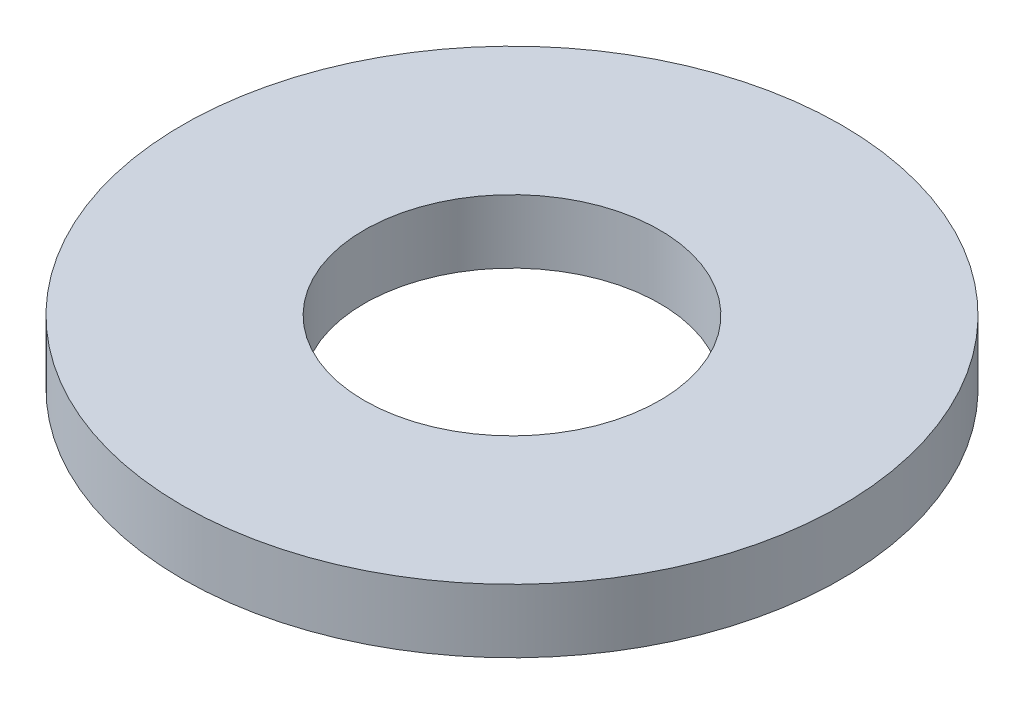
ISO-10303-21;
HEADER;
FILE_DESCRIPTION(('STEP AP214'),'2;1');
FILE_NAME('part.step','',(''),(''),'','','');
FILE_SCHEMA(('AUTOMOTIVE_DESIGN { 1 0 10303 214 1 1 1 1 }'));
ENDSEC;
DATA;
#1=APPLICATION_CONTEXT('core data for automotive mechanical design processes');
#2=APPLICATION_PROTOCOL_DEFINITION('international standard','automotive_design',2000,#1);
#3=PRODUCT_CONTEXT('',#1,'mechanical');
#4=PRODUCT('Part','Part','',(#3));
#5=PRODUCT_RELATED_PRODUCT_CATEGORY('part','',(#4));
#6=PRODUCT_DEFINITION_FORMATION('','',#4);
#7=PRODUCT_DEFINITION_CONTEXT('part definition',#1,'design');
#8=PRODUCT_DEFINITION('design','',#6,#7);
#9=PRODUCT_DEFINITION_SHAPE('','',#8);
#10=(LENGTH_UNIT() NAMED_UNIT(*) SI_UNIT(.MILLI.,.METRE.));
#11=(NAMED_UNIT(*) PLANE_ANGLE_UNIT() SI_UNIT($,.RADIAN.));
#12=(NAMED_UNIT(*) SI_UNIT($,.STERADIAN.) SOLID_ANGLE_UNIT());
#13=UNCERTAINTY_MEASURE_WITH_UNIT(LENGTH_MEASURE(1.E-05),#10,'distance_accuracy_value','');
#14=(GEOMETRIC_REPRESENTATION_CONTEXT(3) GLOBAL_UNCERTAINTY_ASSIGNED_CONTEXT((#13)) GLOBAL_UNIT_ASSIGNED_CONTEXT((#10,
#11,#12)) REPRESENTATION_CONTEXT('',''));
#15=CARTESIAN_POINT('',(0.,0.,0.));
#16=DIRECTION('',(0.,0.,1.));
#17=DIRECTION('',(1.,0.,0.));
#18=AXIS2_PLACEMENT_3D('',#15,#16,#17);
#19=CARTESIAN_POINT('',(0.,14.,0.));
#20=DIRECTION('',(0.,-1.,0.));
#21=DIRECTION('',(0.,0.,-1.));
#22=AXIS2_PLACEMENT_3D('',#19,#20,#21);
#23=CYLINDRICAL_SURFACE('',#22,72.5);
#24=CARTESIAN_POINT('',(0.,14.,0.));
#25=DIRECTION('',(0.,1.,0.));
#26=DIRECTION('',(0.,0.,1.));
#27=AXIS2_PLACEMENT_3D('',#24,#25,#26);
#28=CIRCLE('',#27,72.5);
#29=CARTESIAN_POINT('',(0.,14.,72.5));
#30=VERTEX_POINT('',#29);
#31=EDGE_CURVE('E10',#30,#30,#28,.T.);
#32=ORIENTED_EDGE('',*,*,#31,.F.);
#33=EDGE_LOOP('',(#32));
#34=FACE_BOUND('',#33,.T.);
#35=CARTESIAN_POINT('',(0.,0.,0.));
#36=DIRECTION('',(0.,1.,0.));
#37=DIRECTION('',(0.,0.,1.));
#38=AXIS2_PLACEMENT_3D('',#35,#36,#37);
#39=CIRCLE('',#38,72.5);
#40=CARTESIAN_POINT('',(0.,0.,72.5));
#41=VERTEX_POINT('',#40);
#42=EDGE_CURVE('E37',#41,#41,#39,.T.);
#43=ORIENTED_EDGE('',*,*,#42,.T.);
#44=EDGE_LOOP('',(#43));
#45=FACE_BOUND('',#44,.T.);
#46=ADVANCED_FACE('F40',(#34,#45),#23,.T.);
#47=CARTESIAN_POINT('',(0.,14.,0.));
#48=DIRECTION('',(0.,1.,0.));
#49=DIRECTION('',(0.,0.,1.));
#50=AXIS2_PLACEMENT_3D('',#47,#48,#49);
#51=PLANE('',#50);
#52=CARTESIAN_POINT('',(0.,14.,0.));
#53=DIRECTION('',(0.,1.,0.));
#54=DIRECTION('',(0.,0.,1.));
#55=AXIS2_PLACEMENT_3D('',#52,#53,#54);
#56=CIRCLE('',#55,32.5);
#57=CARTESIAN_POINT('',(0.,14.,32.5));
#58=VERTEX_POINT('',#57);
#59=EDGE_CURVE('E50',#58,#58,#56,.T.);
#60=ORIENTED_EDGE('',*,*,#59,.F.);
#61=EDGE_LOOP('',(#60));
#62=FACE_BOUND('',#61,.T.);
#63=ORIENTED_EDGE('',*,*,#31,.T.);
#64=EDGE_LOOP('',(#63));
#65=FACE_BOUND('',#64,.T.);
#66=ADVANCED_FACE('F59',(#62,#65),#51,.T.);
#67=CARTESIAN_POINT('',(0.,0.,0.));
#68=DIRECTION('',(0.,1.,0.));
#69=DIRECTION('',(0.,0.,1.));
#70=AXIS2_PLACEMENT_3D('',#67,#68,#69);
#71=PLANE('',#70);
#72=CARTESIAN_POINT('',(0.,0.,0.));
#73=DIRECTION('',(0.,1.,0.));
#74=DIRECTION('',(0.,0.,1.));
#75=AXIS2_PLACEMENT_3D('',#72,#73,#74);
#76=CIRCLE('',#75,32.5);
#77=CARTESIAN_POINT('',(0.,0.,32.5));
#78=VERTEX_POINT('',#77);
#79=EDGE_CURVE('E47',#78,#78,#76,.T.);
#80=ORIENTED_EDGE('',*,*,#79,.T.);
#81=EDGE_LOOP('',(#80));
#82=FACE_BOUND('',#81,.T.);
#83=ORIENTED_EDGE('',*,*,#42,.F.);
#84=EDGE_LOOP('',(#83));
#85=FACE_BOUND('',#84,.T.);
#86=ADVANCED_FACE('F58',(#82,#85),#71,.F.);
#87=CARTESIAN_POINT('',(0.,14.,0.));
#88=DIRECTION('',(0.,-1.,0.));
#89=DIRECTION('',(0.,0.,-1.));
#90=AXIS2_PLACEMENT_3D('',#87,#88,#89);
#91=CYLINDRICAL_SURFACE('',#90,32.5);
#92=ORIENTED_EDGE('',*,*,#59,.T.);
#93=EDGE_LOOP('',(#92));
#94=FACE_BOUND('',#93,.T.);
#95=ORIENTED_EDGE('',*,*,#79,.F.);
#96=EDGE_LOOP('',(#95));
#97=FACE_BOUND('',#96,.T.);
#98=ADVANCED_FACE('F54',(#94,#97),#91,.F.);
#99=CLOSED_SHELL('',(#46,#66,#86,#98));
#100=MANIFOLD_SOLID_BREP('B2',#99);
#101=ADVANCED_BREP_SHAPE_REPRESENTATION('',(#18,#100),#14);
#102=SHAPE_DEFINITION_REPRESENTATION(#9,#101);
ENDSEC;
END-ISO-10303-21;
